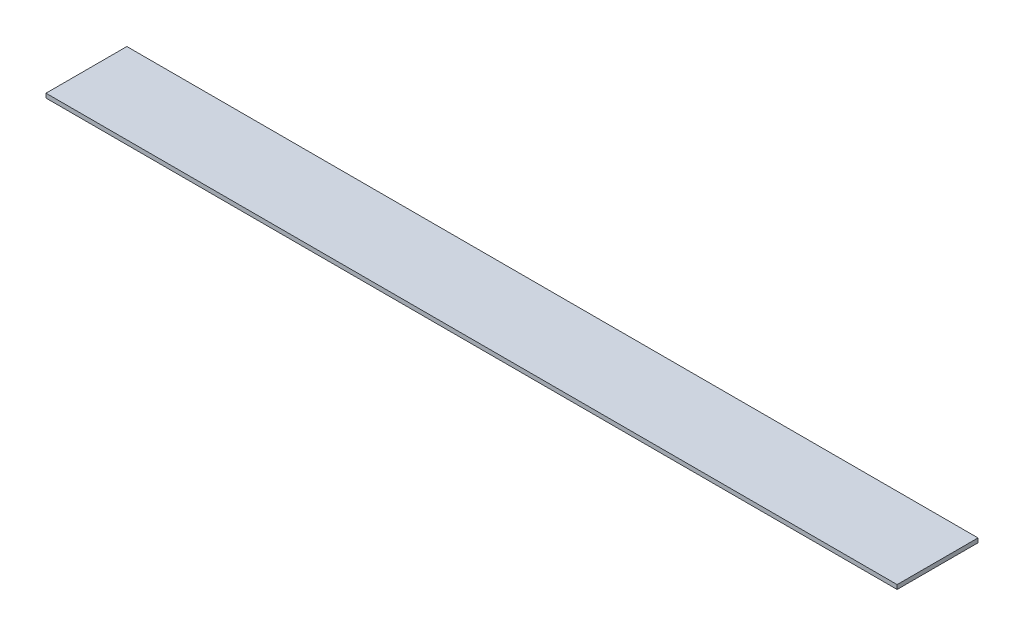
ISO-10303-21;
HEADER;
FILE_DESCRIPTION(('STEP AP214'),'2;1');
FILE_NAME('part.step','',(''),(''),'','','');
FILE_SCHEMA(('AUTOMOTIVE_DESIGN { 1 0 10303 214 1 1 1 1 }'));
ENDSEC;
DATA;
#1=APPLICATION_CONTEXT('core data for automotive mechanical design processes');
#2=APPLICATION_PROTOCOL_DEFINITION('international standard','automotive_design',2000,#1);
#3=PRODUCT_CONTEXT('',#1,'mechanical');
#4=PRODUCT('Part','Part','',(#3));
#5=PRODUCT_RELATED_PRODUCT_CATEGORY('part','',(#4));
#6=PRODUCT_DEFINITION_FORMATION('','',#4);
#7=PRODUCT_DEFINITION_CONTEXT('part definition',#1,'design');
#8=PRODUCT_DEFINITION('design','',#6,#7);
#9=PRODUCT_DEFINITION_SHAPE('','',#8);
#10=(LENGTH_UNIT() NAMED_UNIT(*) SI_UNIT(.MILLI.,.METRE.));
#11=(NAMED_UNIT(*) PLANE_ANGLE_UNIT() SI_UNIT($,.RADIAN.));
#12=(NAMED_UNIT(*) SI_UNIT($,.STERADIAN.) SOLID_ANGLE_UNIT());
#13=UNCERTAINTY_MEASURE_WITH_UNIT(LENGTH_MEASURE(1.E-05),#10,'distance_accuracy_value','');
#14=(GEOMETRIC_REPRESENTATION_CONTEXT(3) GLOBAL_UNCERTAINTY_ASSIGNED_CONTEXT((#13)) GLOBAL_UNIT_ASSIGNED_CONTEXT((#10,
#11,#12)) REPRESENTATION_CONTEXT('',''));
#15=CARTESIAN_POINT('',(0.,0.,0.));
#16=DIRECTION('',(0.,0.,1.));
#17=DIRECTION('',(1.,0.,0.));
#18=AXIS2_PLACEMENT_3D('',#15,#16,#17);
#19=CARTESIAN_POINT('',(0.,0.,3.));
#20=DIRECTION('',(0.,0.,1.));
#21=DIRECTION('',(1.,0.,0.));
#22=AXIS2_PLACEMENT_3D('',#19,#20,#21);
#23=PLANE('',#22);
#24=DIRECTION('',(0.,1.,0.));
#25=VECTOR('',#24,1.);
#26=CARTESIAN_POINT('',(-300.,0.,3.));
#27=LINE('',#26,#25);
#28=CARTESIAN_POINT('',(-300.,47.,3.));
#29=VERTEX_POINT('',#28);
#30=CARTESIAN_POINT('',(-300.,50.,3.));
#31=VERTEX_POINT('',#30);
#32=EDGE_CURVE('E11',#29,#31,#27,.T.);
#33=ORIENTED_EDGE('',*,*,#32,.T.);
#34=DIRECTION('',(-1.,0.,0.));
#35=VECTOR('',#34,1.);
#36=CARTESIAN_POINT('',(-300.,50.,3.));
#37=LINE('',#36,#35);
#38=CARTESIAN_POINT('',(300.,50.,3.));
#39=VERTEX_POINT('',#38);
#40=EDGE_CURVE('E87',#39,#31,#37,.T.);
#41=ORIENTED_EDGE('',*,*,#40,.F.);
#42=DIRECTION('',(0.,1.,0.));
#43=VECTOR('',#42,1.);
#44=CARTESIAN_POINT('',(300.,1.71683972880179E-13,3.));
#45=LINE('',#44,#43);
#46=CARTESIAN_POINT('',(300.,47.,3.));
#47=VERTEX_POINT('',#46);
#48=EDGE_CURVE('E40',#47,#39,#45,.T.);
#49=ORIENTED_EDGE('',*,*,#48,.F.);
#50=DIRECTION('',(1.,0.,0.));
#51=VECTOR('',#50,1.);
#52=CARTESIAN_POINT('',(300.,47.,3.));
#53=LINE('',#52,#51);
#54=EDGE_CURVE('E35',#29,#47,#53,.T.);
#55=ORIENTED_EDGE('',*,*,#54,.F.);
#56=EDGE_LOOP('',(#33,#41,#49,#55));
#57=FACE_BOUND('',#56,.T.);
#58=ADVANCED_FACE('F32',(#57),#23,.F.);
#59=CARTESIAN_POINT('',(-300.,0.,60.));
#60=DIRECTION('',(0.,0.,1.));
#61=DIRECTION('',(1.,0.,0.));
#62=AXIS2_PLACEMENT_3D('',#59,#60,#61);
#63=PLANE('',#62);
#64=DIRECTION('',(-1.,0.,0.));
#65=VECTOR('',#64,1.);
#66=CARTESIAN_POINT('',(-300.,50.,60.));
#67=LINE('',#66,#65);
#68=CARTESIAN_POINT('',(300.,50.,60.));
#69=VERTEX_POINT('',#68);
#70=CARTESIAN_POINT('',(-300.,50.,60.));
#71=VERTEX_POINT('',#70);
#72=EDGE_CURVE('E91',#69,#71,#67,.T.);
#73=ORIENTED_EDGE('',*,*,#72,.T.);
#74=DIRECTION('',(0.,-1.,0.));
#75=VECTOR('',#74,1.);
#76=CARTESIAN_POINT('',(-300.,0.,60.));
#77=LINE('',#76,#75);
#78=CARTESIAN_POINT('',(-300.,47.,60.));
#79=VERTEX_POINT('',#78);
#80=EDGE_CURVE('E75',#71,#79,#77,.T.);
#81=ORIENTED_EDGE('',*,*,#80,.T.);
#82=DIRECTION('',(-1.,0.,0.));
#83=VECTOR('',#82,1.);
#84=CARTESIAN_POINT('',(300.,47.,60.));
#85=LINE('',#84,#83);
#86=CARTESIAN_POINT('',(300.,47.,60.));
#87=VERTEX_POINT('',#86);
#88=EDGE_CURVE('E80',#87,#79,#85,.T.);
#89=ORIENTED_EDGE('',*,*,#88,.F.);
#90=DIRECTION('',(0.,-1.,0.));
#91=VECTOR('',#90,1.);
#92=CARTESIAN_POINT('',(300.,3.43367945760358E-13,60.));
#93=LINE('',#92,#91);
#94=EDGE_CURVE('E93',#69,#87,#93,.T.);
#95=ORIENTED_EDGE('',*,*,#94,.F.);
#96=EDGE_LOOP('',(#73,#81,#89,#95));
#97=FACE_BOUND('',#96,.T.);
#98=ADVANCED_FACE('F89',(#97),#63,.T.);
#99=CARTESIAN_POINT('',(-300.,0.,0.));
#100=DIRECTION('',(-1.,0.,0.));
#101=DIRECTION('',(0.,0.,1.));
#102=AXIS2_PLACEMENT_3D('',#99,#100,#101);
#103=PLANE('',#102);
#104=ORIENTED_EDGE('',*,*,#32,.F.);
#105=DIRECTION('',(0.,0.,1.));
#106=VECTOR('',#105,1.);
#107=CARTESIAN_POINT('',(-300.,47.,3.));
#108=LINE('',#107,#106);
#109=EDGE_CURVE('E70',#29,#79,#108,.T.);
#110=ORIENTED_EDGE('',*,*,#109,.T.);
#111=ORIENTED_EDGE('',*,*,#80,.F.);
#112=DIRECTION('',(0.,0.,-1.));
#113=VECTOR('',#112,1.);
#114=CARTESIAN_POINT('',(-300.,50.,60.));
#115=LINE('',#114,#113);
#116=EDGE_CURVE('E77',#71,#31,#115,.T.);
#117=ORIENTED_EDGE('',*,*,#116,.T.);
#118=EDGE_LOOP('',(#104,#110,#111,#117));
#119=FACE_BOUND('',#118,.T.);
#120=ADVANCED_FACE('F72',(#119),#103,.T.);
#121=CARTESIAN_POINT('',(300.,1.71683972880179E-13,0.));
#122=DIRECTION('',(-1.,0.,0.));
#123=DIRECTION('',(0.,-1.,0.));
#124=AXIS2_PLACEMENT_3D('',#121,#122,#123);
#125=PLANE('',#124);
#126=DIRECTION('',(0.,0.,1.));
#127=VECTOR('',#126,1.);
#128=CARTESIAN_POINT('',(300.,47.,3.));
#129=LINE('',#128,#127);
#130=EDGE_CURVE('E83',#47,#87,#129,.T.);
#131=ORIENTED_EDGE('',*,*,#130,.F.);
#132=ORIENTED_EDGE('',*,*,#48,.T.);
#133=DIRECTION('',(0.,0.,-1.));
#134=VECTOR('',#133,1.);
#135=CARTESIAN_POINT('',(300.,50.,60.));
#136=LINE('',#135,#134);
#137=EDGE_CURVE('E92',#69,#39,#136,.T.);
#138=ORIENTED_EDGE('',*,*,#137,.F.);
#139=ORIENTED_EDGE('',*,*,#94,.T.);
#140=EDGE_LOOP('',(#131,#132,#138,#139));
#141=FACE_BOUND('',#140,.T.);
#142=ADVANCED_FACE('F103',(#141),#125,.F.);
#143=CARTESIAN_POINT('',(-300.,50.,60.));
#144=DIRECTION('',(0.,-1.,0.));
#145=DIRECTION('',(0.,0.,-1.));
#146=AXIS2_PLACEMENT_3D('',#143,#144,#145);
#147=PLANE('',#146);
#148=ORIENTED_EDGE('',*,*,#137,.T.);
#149=ORIENTED_EDGE('',*,*,#40,.T.);
#150=ORIENTED_EDGE('',*,*,#116,.F.);
#151=ORIENTED_EDGE('',*,*,#72,.F.);
#152=EDGE_LOOP('',(#148,#149,#150,#151));
#153=FACE_BOUND('',#152,.T.);
#154=ADVANCED_FACE('F105',(#153),#147,.F.);
#155=CARTESIAN_POINT('',(300.,47.,3.));
#156=DIRECTION('',(0.,1.,0.));
#157=DIRECTION('',(0.,0.,1.));
#158=AXIS2_PLACEMENT_3D('',#155,#156,#157);
#159=PLANE('',#158);
#160=ORIENTED_EDGE('',*,*,#109,.F.);
#161=ORIENTED_EDGE('',*,*,#54,.T.);
#162=ORIENTED_EDGE('',*,*,#130,.T.);
#163=ORIENTED_EDGE('',*,*,#88,.T.);
#164=EDGE_LOOP('',(#160,#161,#162,#163));
#165=FACE_BOUND('',#164,.T.);
#166=ADVANCED_FACE('F81',(#165),#159,.F.);
#167=CLOSED_SHELL('',(#58,#98,#120,#142,#154,#166));
#168=MANIFOLD_SOLID_BREP('B2',#167);
#169=ADVANCED_BREP_SHAPE_REPRESENTATION('',(#18,#168),#14);
#170=SHAPE_DEFINITION_REPRESENTATION(#9,#169);
ENDSEC;
END-ISO-10303-21;
